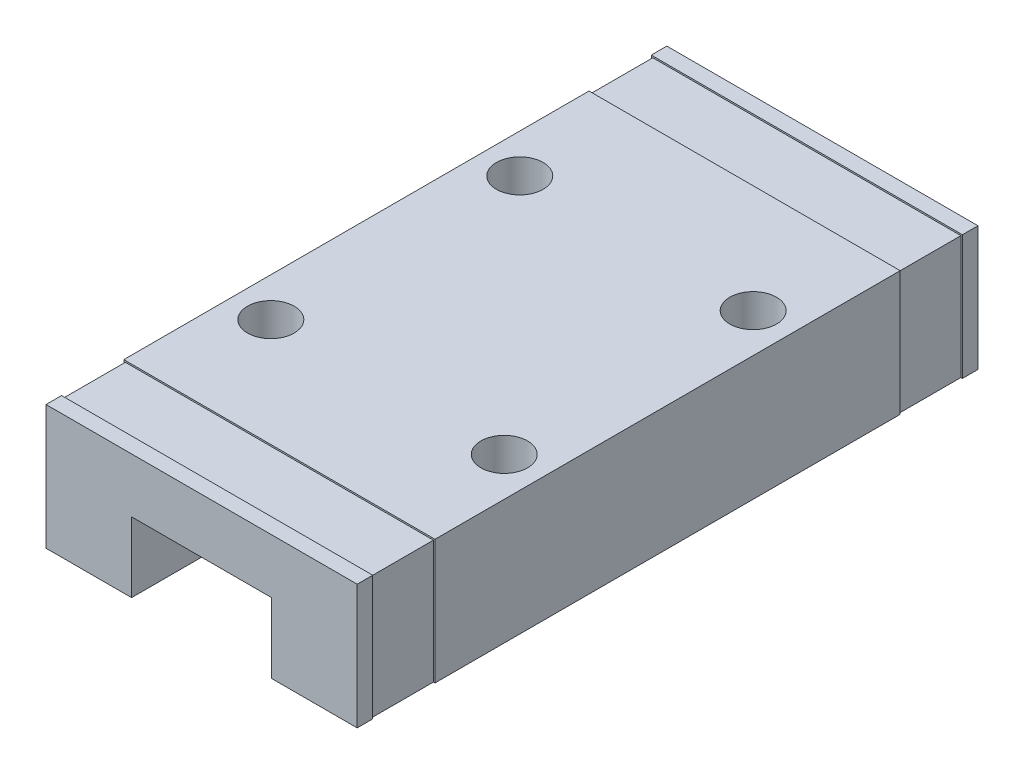
ISO-10303-21;
HEADER;
FILE_DESCRIPTION(('STEP AP214'),'2;1');
FILE_NAME('part.step','',(''),(''),'','','');
FILE_SCHEMA(('AUTOMOTIVE_DESIGN { 1 0 10303 214 1 1 1 1 }'));
ENDSEC;
DATA;
#1=APPLICATION_CONTEXT('core data for automotive mechanical design processes');
#2=APPLICATION_PROTOCOL_DEFINITION('international standard','automotive_design',2000,#1);
#3=PRODUCT_CONTEXT('',#1,'mechanical');
#4=PRODUCT('Part','Part','',(#3));
#5=PRODUCT_RELATED_PRODUCT_CATEGORY('part','',(#4));
#6=PRODUCT_DEFINITION_FORMATION('','',#4);
#7=PRODUCT_DEFINITION_CONTEXT('part definition',#1,'design');
#8=PRODUCT_DEFINITION('design','',#6,#7);
#9=PRODUCT_DEFINITION_SHAPE('','',#8);
#10=(LENGTH_UNIT() NAMED_UNIT(*) SI_UNIT(.MILLI.,.METRE.));
#11=(NAMED_UNIT(*) PLANE_ANGLE_UNIT() SI_UNIT($,.RADIAN.));
#12=(NAMED_UNIT(*) SI_UNIT($,.STERADIAN.) SOLID_ANGLE_UNIT());
#13=UNCERTAINTY_MEASURE_WITH_UNIT(LENGTH_MEASURE(1.E-05),#10,'distance_accuracy_value','');
#14=(GEOMETRIC_REPRESENTATION_CONTEXT(3) GLOBAL_UNCERTAINTY_ASSIGNED_CONTEXT((#13)) GLOBAL_UNIT_ASSIGNED_CONTEXT((#10,
#11,#12)) REPRESENTATION_CONTEXT('',''));
#15=CARTESIAN_POINT('',(0.,0.,0.));
#16=DIRECTION('',(0.,0.,1.));
#17=DIRECTION('',(1.,0.,0.));
#18=AXIS2_PLACEMENT_3D('',#15,#16,#17);
#19=CARTESIAN_POINT('',(20.,0.,39.9));
#20=DIRECTION('',(-1.,0.,0.));
#21=DIRECTION('',(0.,0.,1.));
#22=AXIS2_PLACEMENT_3D('',#19,#20,#21);
#23=PLANE('',#22);
#24=DIRECTION('',(0.,1.,0.));
#25=VECTOR('',#24,1.);
#26=CARTESIAN_POINT('',(20.,7.9,34.9));
#27=LINE('',#26,#25);
#28=CARTESIAN_POINT('',(20.,0.,34.9));
#29=VERTEX_POINT('',#28);
#30=CARTESIAN_POINT('',(20.,8.,34.9));
#31=VERTEX_POINT('',#30);
#32=EDGE_CURVE('E245',#29,#31,#27,.T.);
#33=ORIENTED_EDGE('',*,*,#32,.F.);
#34=DIRECTION('',(0.,0.,-1.));
#35=VECTOR('',#34,1.);
#36=CARTESIAN_POINT('',(20.,0.,39.9));
#37=LINE('',#36,#35);
#38=CARTESIAN_POINT('',(20.,0.,5.));
#39=VERTEX_POINT('',#38);
#40=EDGE_CURVE('E315',#29,#39,#37,.T.);
#41=ORIENTED_EDGE('',*,*,#40,.T.);
#42=DIRECTION('',(0.,1.,0.));
#43=VECTOR('',#42,1.);
#44=CARTESIAN_POINT('',(20.,7.9,5.));
#45=LINE('',#44,#43);
#46=CARTESIAN_POINT('',(20.,8.,5.));
#47=VERTEX_POINT('',#46);
#48=EDGE_CURVE('E354',#39,#47,#45,.T.);
#49=ORIENTED_EDGE('',*,*,#48,.T.);
#50=DIRECTION('',(0.,0.,-1.));
#51=VECTOR('',#50,1.);
#52=CARTESIAN_POINT('',(20.,8.,39.9));
#53=LINE('',#52,#51);
#54=EDGE_CURVE('E313',#31,#47,#53,.T.);
#55=ORIENTED_EDGE('',*,*,#54,.F.);
#56=EDGE_LOOP('',(#33,#41,#49,#55));
#57=FACE_BOUND('',#56,.T.);
#58=ADVANCED_FACE('F45',(#57),#23,.F.);
#59=CARTESIAN_POINT('',(20.,0.,39.9));
#60=VERTEX_POINT('',#59);
#61=CARTESIAN_POINT('',(20.,0.,38.9));
#62=VERTEX_POINT('',#61);
#63=EDGE_CURVE('E53',#60,#62,#37,.T.);
#64=ORIENTED_EDGE('',*,*,#63,.T.);
#65=DIRECTION('',(0.,1.,0.));
#66=VECTOR('',#65,1.);
#67=CARTESIAN_POINT('',(20.,7.9,38.9));
#68=LINE('',#67,#66);
#69=CARTESIAN_POINT('',(20.,8.,38.9));
#70=VERTEX_POINT('',#69);
#71=EDGE_CURVE('E231',#62,#70,#68,.T.);
#72=ORIENTED_EDGE('',*,*,#71,.T.);
#73=CARTESIAN_POINT('',(20.,8.,39.9));
#74=VERTEX_POINT('',#73);
#75=EDGE_CURVE('E310',#74,#70,#53,.T.);
#76=ORIENTED_EDGE('',*,*,#75,.F.);
#77=DIRECTION('',(0.,1.,0.));
#78=VECTOR('',#77,1.);
#79=CARTESIAN_POINT('',(20.,0.,39.9));
#80=LINE('',#79,#78);
#81=EDGE_CURVE('E255',#60,#74,#80,.T.);
#82=ORIENTED_EDGE('',*,*,#81,.F.);
#83=EDGE_LOOP('',(#64,#72,#76,#82));
#84=FACE_BOUND('',#83,.T.);
#85=ADVANCED_FACE('F474',(#84),#23,.F.);
#86=CARTESIAN_POINT('',(0.,7.9,0.));
#87=DIRECTION('',(0.,1.,0.));
#88=DIRECTION('',(-1.,0.,0.));
#89=AXIS2_PLACEMENT_3D('',#86,#87,#88);
#90=PLANE('',#89);
#91=DIRECTION('',(1.,0.,0.));
#92=VECTOR('',#91,1.);
#93=CARTESIAN_POINT('',(0.,7.9,5.));
#94=LINE('',#93,#92);
#95=CARTESIAN_POINT('',(0.1,7.9,5.));
#96=VERTEX_POINT('',#95);
#97=CARTESIAN_POINT('',(19.9,7.9,5.));
#98=VERTEX_POINT('',#97);
#99=EDGE_CURVE('E365',#96,#98,#94,.T.);
#100=ORIENTED_EDGE('',*,*,#99,.T.);
#101=DIRECTION('',(0.,0.,1.));
#102=VECTOR('',#101,1.);
#103=CARTESIAN_POINT('',(19.9,7.9,5.));
#104=LINE('',#103,#102);
#105=CARTESIAN_POINT('',(19.9,7.9,1.));
#106=VERTEX_POINT('',#105);
#107=EDGE_CURVE('E403',#106,#98,#104,.T.);
#108=ORIENTED_EDGE('',*,*,#107,.F.);
#109=DIRECTION('',(-1.,0.,0.));
#110=VECTOR('',#109,1.);
#111=CARTESIAN_POINT('',(0.,7.9,1.));
#112=LINE('',#111,#110);
#113=CARTESIAN_POINT('',(0.1,7.9,1.));
#114=VERTEX_POINT('',#113);
#115=EDGE_CURVE('E360',#106,#114,#112,.T.);
#116=ORIENTED_EDGE('',*,*,#115,.T.);
#117=DIRECTION('',(0.,0.,-1.));
#118=VECTOR('',#117,1.);
#119=CARTESIAN_POINT('',(0.1,7.9,5.));
#120=LINE('',#119,#118);
#121=EDGE_CURVE('E397',#96,#114,#120,.T.);
#122=ORIENTED_EDGE('',*,*,#121,.F.);
#123=EDGE_LOOP('',(#100,#108,#116,#122));
#124=FACE_BOUND('',#123,.T.);
#125=ADVANCED_FACE('F479',(#124),#90,.T.);
#126=CARTESIAN_POINT('',(0.,0.,39.9));
#127=DIRECTION('',(-1.,0.,0.));
#128=DIRECTION('',(0.,0.,1.));
#129=AXIS2_PLACEMENT_3D('',#126,#127,#128);
#130=PLANE('',#129);
#131=DIRECTION('',(0.,1.,0.));
#132=VECTOR('',#131,1.);
#133=CARTESIAN_POINT('',(0.,7.9,5.));
#134=LINE('',#133,#132);
#135=CARTESIAN_POINT('',(0.,0.,5.));
#136=VERTEX_POINT('',#135);
#137=CARTESIAN_POINT('',(0.,8.,5.));
#138=VERTEX_POINT('',#137);
#139=EDGE_CURVE('E357',#136,#138,#134,.T.);
#140=ORIENTED_EDGE('',*,*,#139,.F.);
#141=DIRECTION('',(0.,0.,-1.));
#142=VECTOR('',#141,1.);
#143=CARTESIAN_POINT('',(0.,0.,39.9));
#144=LINE('',#143,#142);
#145=CARTESIAN_POINT('',(0.,0.,34.9));
#146=VERTEX_POINT('',#145);
#147=EDGE_CURVE('E304',#146,#136,#144,.T.);
#148=ORIENTED_EDGE('',*,*,#147,.F.);
#149=DIRECTION('',(0.,1.,0.));
#150=VECTOR('',#149,1.);
#151=CARTESIAN_POINT('',(0.,7.9,34.9));
#152=LINE('',#151,#150);
#153=CARTESIAN_POINT('',(0.,8.,34.9));
#154=VERTEX_POINT('',#153);
#155=EDGE_CURVE('E241',#146,#154,#152,.T.);
#156=ORIENTED_EDGE('',*,*,#155,.T.);
#157=DIRECTION('',(0.,0.,-1.));
#158=VECTOR('',#157,1.);
#159=CARTESIAN_POINT('',(0.,8.,39.9));
#160=LINE('',#159,#158);
#161=EDGE_CURVE('E309',#154,#138,#160,.T.);
#162=ORIENTED_EDGE('',*,*,#161,.T.);
#163=EDGE_LOOP('',(#140,#148,#156,#162));
#164=FACE_BOUND('',#163,.T.);
#165=ADVANCED_FACE('F516',(#164),#130,.T.);
#166=CARTESIAN_POINT('',(0.,0.,1.));
#167=VERTEX_POINT('',#166);
#168=CARTESIAN_POINT('',(0.,0.,0.));
#169=VERTEX_POINT('',#168);
#170=EDGE_CURVE('E299',#167,#169,#144,.T.);
#171=ORIENTED_EDGE('',*,*,#170,.F.);
#172=DIRECTION('',(0.,1.,0.));
#173=VECTOR('',#172,1.);
#174=CARTESIAN_POINT('',(0.,7.9,1.));
#175=LINE('',#174,#173);
#176=CARTESIAN_POINT('',(0.,8.,1.));
#177=VERTEX_POINT('',#176);
#178=EDGE_CURVE('E274',#167,#177,#175,.T.);
#179=ORIENTED_EDGE('',*,*,#178,.T.);
#180=CARTESIAN_POINT('',(0.,8.,0.));
#181=VERTEX_POINT('',#180);
#182=EDGE_CURVE('E303',#177,#181,#160,.T.);
#183=ORIENTED_EDGE('',*,*,#182,.T.);
#184=DIRECTION('',(0.,1.,0.));
#185=VECTOR('',#184,1.);
#186=CARTESIAN_POINT('',(0.,0.,0.));
#187=LINE('',#186,#185);
#188=EDGE_CURVE('E283',#169,#181,#187,.T.);
#189=ORIENTED_EDGE('',*,*,#188,.F.);
#190=EDGE_LOOP('',(#171,#179,#183,#189));
#191=FACE_BOUND('',#190,.T.);
#192=ADVANCED_FACE('F514',(#191),#130,.T.);
#193=CARTESIAN_POINT('',(0.,7.9,0.));
#194=DIRECTION('',(0.,-1.,0.));
#195=DIRECTION('',(1.,0.,0.));
#196=AXIS2_PLACEMENT_3D('',#193,#194,#195);
#197=PLANE('',#196);
#198=DIRECTION('',(1.,0.,0.));
#199=VECTOR('',#198,1.);
#200=CARTESIAN_POINT('',(0.,7.9,38.9));
#201=LINE('',#200,#199);
#202=CARTESIAN_POINT('',(0.1,7.9,38.9));
#203=VERTEX_POINT('',#202);
#204=CARTESIAN_POINT('',(19.9,7.9,38.9));
#205=VERTEX_POINT('',#204);
#206=EDGE_CURVE('E222',#203,#205,#201,.T.);
#207=ORIENTED_EDGE('',*,*,#206,.T.);
#208=DIRECTION('',(0.,0.,1.));
#209=VECTOR('',#208,1.);
#210=CARTESIAN_POINT('',(19.9,7.9,34.9));
#211=LINE('',#210,#209);
#212=CARTESIAN_POINT('',(19.9,7.9,34.9));
#213=VERTEX_POINT('',#212);
#214=EDGE_CURVE('E60',#213,#205,#211,.T.);
#215=ORIENTED_EDGE('',*,*,#214,.F.);
#216=DIRECTION('',(-1.,0.,0.));
#217=VECTOR('',#216,1.);
#218=CARTESIAN_POINT('',(0.,7.9,34.9));
#219=LINE('',#218,#217);
#220=CARTESIAN_POINT('',(0.1,7.9,34.9));
#221=VERTEX_POINT('',#220);
#222=EDGE_CURVE('E219',#213,#221,#219,.T.);
#223=ORIENTED_EDGE('',*,*,#222,.T.);
#224=DIRECTION('',(0.,0.,-1.));
#225=VECTOR('',#224,1.);
#226=CARTESIAN_POINT('',(0.1,7.9,34.9));
#227=LINE('',#226,#225);
#228=EDGE_CURVE('E374',#203,#221,#227,.T.);
#229=ORIENTED_EDGE('',*,*,#228,.F.);
#230=EDGE_LOOP('',(#207,#215,#223,#229));
#231=FACE_BOUND('',#230,.T.);
#232=ADVANCED_FACE('F217',(#231),#197,.F.);
#233=CARTESIAN_POINT('',(0.,8.,39.9));
#234=DIRECTION('',(0.,1.,0.));
#235=DIRECTION('',(-1.,0.,0.));
#236=AXIS2_PLACEMENT_3D('',#233,#234,#235);
#237=PLANE('',#236);
#238=DIRECTION('',(-1.,0.,0.));
#239=VECTOR('',#238,1.);
#240=CARTESIAN_POINT('',(0.,8.,1.));
#241=LINE('',#240,#239);
#242=CARTESIAN_POINT('',(20.,8.,1.));
#243=VERTEX_POINT('',#242);
#244=EDGE_CURVE('E343',#243,#177,#241,.T.);
#245=ORIENTED_EDGE('',*,*,#244,.F.);
#246=CARTESIAN_POINT('',(20.,8.,0.));
#247=VERTEX_POINT('',#246);
#248=EDGE_CURVE('E308',#243,#247,#53,.T.);
#249=ORIENTED_EDGE('',*,*,#248,.T.);
#250=DIRECTION('',(1.,0.,0.));
#251=VECTOR('',#250,1.);
#252=CARTESIAN_POINT('',(0.,8.,0.));
#253=LINE('',#252,#251);
#254=EDGE_CURVE('E280',#181,#247,#253,.T.);
#255=ORIENTED_EDGE('',*,*,#254,.F.);
#256=ORIENTED_EDGE('',*,*,#182,.F.);
#257=EDGE_LOOP('',(#245,#249,#255,#256));
#258=FACE_BOUND('',#257,.T.);
#259=ADVANCED_FACE('F342',(#258),#237,.T.);
#260=CARTESIAN_POINT('',(17.5,8.,11.95));
#261=DIRECTION('',(0.,1.,0.));
#262=DIRECTION('',(-1.,0.,0.));
#263=AXIS2_PLACEMENT_3D('',#260,#261,#262);
#264=CIRCLE('',#263,1.5);
#265=CARTESIAN_POINT('',(16.,8.,11.95));
#266=VERTEX_POINT('',#265);
#267=EDGE_CURVE('E432',#266,#266,#264,.T.);
#268=ORIENTED_EDGE('',*,*,#267,.F.);
#269=EDGE_LOOP('',(#268));
#270=FACE_BOUND('',#269,.T.);
#271=CARTESIAN_POINT('',(2.5,8.,27.95));
#272=DIRECTION('',(0.,1.,0.));
#273=DIRECTION('',(-1.,0.,0.));
#274=AXIS2_PLACEMENT_3D('',#271,#272,#273);
#275=CIRCLE('',#274,1.5);
#276=CARTESIAN_POINT('',(1.,8.,27.95));
#277=VERTEX_POINT('',#276);
#278=EDGE_CURVE('E425',#277,#277,#275,.T.);
#279=ORIENTED_EDGE('',*,*,#278,.F.);
#280=EDGE_LOOP('',(#279));
#281=FACE_BOUND('',#280,.T.);
#282=CARTESIAN_POINT('',(17.5,8.,27.95));
#283=DIRECTION('',(0.,1.,0.));
#284=DIRECTION('',(-1.,0.,0.));
#285=AXIS2_PLACEMENT_3D('',#282,#283,#284);
#286=CIRCLE('',#285,1.5);
#287=CARTESIAN_POINT('',(16.,8.,27.95));
#288=VERTEX_POINT('',#287);
#289=EDGE_CURVE('E437',#288,#288,#286,.T.);
#290=ORIENTED_EDGE('',*,*,#289,.F.);
#291=EDGE_LOOP('',(#290));
#292=FACE_BOUND('',#291,.T.);
#293=CARTESIAN_POINT('',(2.5,8.,11.95));
#294=DIRECTION('',(0.,1.,0.));
#295=DIRECTION('',(-1.,0.,0.));
#296=AXIS2_PLACEMENT_3D('',#293,#294,#295);
#297=CIRCLE('',#296,1.5);
#298=CARTESIAN_POINT('',(1.,8.,11.95));
#299=VERTEX_POINT('',#298);
#300=EDGE_CURVE('E419',#299,#299,#297,.T.);
#301=ORIENTED_EDGE('',*,*,#300,.F.);
#302=EDGE_LOOP('',(#301));
#303=FACE_BOUND('',#302,.T.);
#304=DIRECTION('',(1.,0.,0.));
#305=VECTOR('',#304,1.);
#306=CARTESIAN_POINT('',(0.,8.,5.));
#307=LINE('',#306,#305);
#308=EDGE_CURVE('E244',#138,#47,#307,.T.);
#309=ORIENTED_EDGE('',*,*,#308,.F.);
#310=ORIENTED_EDGE('',*,*,#161,.F.);
#311=DIRECTION('',(-1.,0.,0.));
#312=VECTOR('',#311,1.);
#313=CARTESIAN_POINT('',(0.,8.,34.9));
#314=LINE('',#313,#312);
#315=EDGE_CURVE('E233',#31,#154,#314,.T.);
#316=ORIENTED_EDGE('',*,*,#315,.F.);
#317=ORIENTED_EDGE('',*,*,#54,.T.);
#318=EDGE_LOOP('',(#309,#310,#316,#317));
#319=FACE_BOUND('',#318,.T.);
#320=ADVANCED_FACE('F349',(#270,#281,#292,#303,#319),#237,.T.);
#321=CARTESIAN_POINT('',(14.5,0.,39.9));
#322=DIRECTION('',(-1.,0.,0.));
#323=DIRECTION('',(0.,0.,1.));
#324=AXIS2_PLACEMENT_3D('',#321,#322,#323);
#325=PLANE('',#324);
#326=DIRECTION('',(0.,1.,0.));
#327=VECTOR('',#326,1.);
#328=CARTESIAN_POINT('',(14.5,0.,0.));
#329=LINE('',#328,#327);
#330=CARTESIAN_POINT('',(14.5,0.,0.));
#331=VERTEX_POINT('',#330);
#332=CARTESIAN_POINT('',(14.5,4.5,0.));
#333=VERTEX_POINT('',#332);
#334=EDGE_CURVE('E270',#331,#333,#329,.T.);
#335=ORIENTED_EDGE('',*,*,#334,.F.);
#336=DIRECTION('',(0.,0.,-1.));
#337=VECTOR('',#336,1.);
#338=CARTESIAN_POINT('',(14.5,0.,39.9));
#339=LINE('',#338,#337);
#340=CARTESIAN_POINT('',(14.5,0.,39.9));
#341=VERTEX_POINT('',#340);
#342=EDGE_CURVE('E11',#341,#331,#339,.T.);
#343=ORIENTED_EDGE('',*,*,#342,.F.);
#344=DIRECTION('',(0.,1.,0.));
#345=VECTOR('',#344,1.);
#346=CARTESIAN_POINT('',(14.5,0.,39.9));
#347=LINE('',#346,#345);
#348=CARTESIAN_POINT('',(14.5,4.5,39.9));
#349=VERTEX_POINT('',#348);
#350=EDGE_CURVE('E249',#341,#349,#347,.T.);
#351=ORIENTED_EDGE('',*,*,#350,.T.);
#352=DIRECTION('',(0.,0.,-1.));
#353=VECTOR('',#352,1.);
#354=CARTESIAN_POINT('',(14.5,4.5,39.9));
#355=LINE('',#354,#353);
#356=EDGE_CURVE('E269',#349,#333,#355,.T.);
#357=ORIENTED_EDGE('',*,*,#356,.T.);
#358=EDGE_LOOP('',(#335,#343,#351,#357));
#359=FACE_BOUND('',#358,.T.);
#360=ADVANCED_FACE('F47',(#359),#325,.T.);
#361=CARTESIAN_POINT('',(0.,0.,39.9));
#362=DIRECTION('',(0.,1.,0.));
#363=DIRECTION('',(0.,0.,1.));
#364=AXIS2_PLACEMENT_3D('',#361,#362,#363);
#365=PLANE('',#364);
#366=ORIENTED_EDGE('',*,*,#40,.F.);
#367=DIRECTION('',(1.,0.,0.));
#368=VECTOR('',#367,1.);
#369=CARTESIAN_POINT('',(19.9,0.,34.9));
#370=LINE('',#369,#368);
#371=CARTESIAN_POINT('',(19.9,0.,34.9));
#372=VERTEX_POINT('',#371);
#373=EDGE_CURVE('E385',#372,#29,#370,.T.);
#374=ORIENTED_EDGE('',*,*,#373,.F.);
#375=DIRECTION('',(0.,0.,-1.));
#376=VECTOR('',#375,1.);
#377=CARTESIAN_POINT('',(19.9,0.,34.9));
#378=LINE('',#377,#376);
#379=CARTESIAN_POINT('',(19.9,0.,38.9));
#380=VERTEX_POINT('',#379);
#381=EDGE_CURVE('E208',#380,#372,#378,.T.);
#382=ORIENTED_EDGE('',*,*,#381,.F.);
#383=DIRECTION('',(1.,0.,0.));
#384=VECTOR('',#383,1.);
#385=CARTESIAN_POINT('',(19.9,0.,38.9));
#386=LINE('',#385,#384);
#387=EDGE_CURVE('E413',#380,#62,#386,.T.);
#388=ORIENTED_EDGE('',*,*,#387,.T.);
#389=ORIENTED_EDGE('',*,*,#63,.F.);
#390=DIRECTION('',(1.,0.,0.));
#391=VECTOR('',#390,1.);
#392=CARTESIAN_POINT('',(0.,0.,39.9));
#393=LINE('',#392,#391);
#394=EDGE_CURVE('E252',#341,#60,#393,.T.);
#395=ORIENTED_EDGE('',*,*,#394,.F.);
#396=ORIENTED_EDGE('',*,*,#342,.T.);
#397=DIRECTION('',(1.,0.,0.));
#398=VECTOR('',#397,1.);
#399=CARTESIAN_POINT('',(0.,0.,0.));
#400=LINE('',#399,#398);
#401=CARTESIAN_POINT('',(20.,0.,0.));
#402=VERTEX_POINT('',#401);
#403=EDGE_CURVE('E273',#331,#402,#400,.T.);
#404=ORIENTED_EDGE('',*,*,#403,.T.);
#405=CARTESIAN_POINT('',(20.,0.,1.));
#406=VERTEX_POINT('',#405);
#407=EDGE_CURVE('E312',#406,#402,#37,.T.);
#408=ORIENTED_EDGE('',*,*,#407,.F.);
#409=DIRECTION('',(1.,0.,0.));
#410=VECTOR('',#409,1.);
#411=CARTESIAN_POINT('',(19.9,0.,1.));
#412=LINE('',#411,#410);
#413=CARTESIAN_POINT('',(19.9,0.,1.));
#414=VERTEX_POINT('',#413);
#415=EDGE_CURVE('E213',#414,#406,#412,.T.);
#416=ORIENTED_EDGE('',*,*,#415,.F.);
#417=DIRECTION('',(0.,0.,-1.));
#418=VECTOR('',#417,1.);
#419=CARTESIAN_POINT('',(19.9,0.,5.));
#420=LINE('',#419,#418);
#421=CARTESIAN_POINT('',(19.9,0.,5.));
#422=VERTEX_POINT('',#421);
#423=EDGE_CURVE('E407',#422,#414,#420,.T.);
#424=ORIENTED_EDGE('',*,*,#423,.F.);
#425=DIRECTION('',(1.,0.,0.));
#426=VECTOR('',#425,1.);
#427=CARTESIAN_POINT('',(19.9,0.,5.));
#428=LINE('',#427,#426);
#429=EDGE_CURVE('E401',#422,#39,#428,.T.);
#430=ORIENTED_EDGE('',*,*,#429,.T.);
#431=EDGE_LOOP('',(#366,#374,#382,#388,#389,#395,#396,#404,#408,#416,#424,#430));
#432=FACE_BOUND('',#431,.T.);
#433=ADVANCED_FACE('F331',(#432),#365,.F.);
#434=DIRECTION('',(0.,1.,0.));
#435=VECTOR('',#434,1.);
#436=CARTESIAN_POINT('',(20.,7.9,1.));
#437=LINE('',#436,#435);
#438=EDGE_CURVE('E325',#406,#243,#437,.T.);
#439=ORIENTED_EDGE('',*,*,#438,.F.);
#440=ORIENTED_EDGE('',*,*,#407,.T.);
#441=DIRECTION('',(0.,1.,0.));
#442=VECTOR('',#441,1.);
#443=CARTESIAN_POINT('',(20.,0.,0.));
#444=LINE('',#443,#442);
#445=EDGE_CURVE('E277',#402,#247,#444,.T.);
#446=ORIENTED_EDGE('',*,*,#445,.T.);
#447=ORIENTED_EDGE('',*,*,#248,.F.);
#448=EDGE_LOOP('',(#439,#440,#446,#447));
#449=FACE_BOUND('',#448,.T.);
#450=ADVANCED_FACE('F322',(#449),#23,.F.);
#451=DIRECTION('',(1.,0.,0.));
#452=VECTOR('',#451,1.);
#453=CARTESIAN_POINT('',(0.,8.,38.9));
#454=LINE('',#453,#452);
#455=CARTESIAN_POINT('',(0.,8.,38.9));
#456=VERTEX_POINT('',#455);
#457=EDGE_CURVE('E237',#456,#70,#454,.T.);
#458=ORIENTED_EDGE('',*,*,#457,.F.);
#459=CARTESIAN_POINT('',(0.,8.,39.9));
#460=VERTEX_POINT('',#459);
#461=EDGE_CURVE('E305',#460,#456,#160,.T.);
#462=ORIENTED_EDGE('',*,*,#461,.F.);
#463=DIRECTION('',(1.,0.,0.));
#464=VECTOR('',#463,1.);
#465=CARTESIAN_POINT('',(0.,8.,39.9));
#466=LINE('',#465,#464);
#467=EDGE_CURVE('E257',#460,#74,#466,.T.);
#468=ORIENTED_EDGE('',*,*,#467,.T.);
#469=ORIENTED_EDGE('',*,*,#75,.T.);
#470=EDGE_LOOP('',(#458,#462,#468,#469));
#471=FACE_BOUND('',#470,.T.);
#472=ADVANCED_FACE('F456',(#471),#237,.T.);
#473=DIRECTION('',(0.,1.,0.));
#474=VECTOR('',#473,1.);
#475=CARTESIAN_POINT('',(0.,7.9,38.9));
#476=LINE('',#475,#474);
#477=CARTESIAN_POINT('',(0.,0.,38.9));
#478=VERTEX_POINT('',#477);
#479=EDGE_CURVE('E229',#478,#456,#476,.T.);
#480=ORIENTED_EDGE('',*,*,#479,.F.);
#481=CARTESIAN_POINT('',(0.,0.,39.9));
#482=VERTEX_POINT('',#481);
#483=EDGE_CURVE('E300',#482,#478,#144,.T.);
#484=ORIENTED_EDGE('',*,*,#483,.F.);
#485=DIRECTION('',(0.,1.,0.));
#486=VECTOR('',#485,1.);
#487=CARTESIAN_POINT('',(0.,0.,39.9));
#488=LINE('',#487,#486);
#489=EDGE_CURVE('E260',#482,#460,#488,.T.);
#490=ORIENTED_EDGE('',*,*,#489,.T.);
#491=ORIENTED_EDGE('',*,*,#461,.T.);
#492=EDGE_LOOP('',(#480,#484,#490,#491));
#493=FACE_BOUND('',#492,.T.);
#494=ADVANCED_FACE('F484',(#493),#130,.T.);
#495=CARTESIAN_POINT('',(0.,0.,39.9));
#496=DIRECTION('',(0.,1.,0.));
#497=DIRECTION('',(0.,0.,1.));
#498=AXIS2_PLACEMENT_3D('',#495,#496,#497);
#499=PLANE('',#498);
#500=ORIENTED_EDGE('',*,*,#147,.T.);
#501=DIRECTION('',(-1.,0.,0.));
#502=VECTOR('',#501,1.);
#503=CARTESIAN_POINT('',(0.1,0.,5.));
#504=LINE('',#503,#502);
#505=CARTESIAN_POINT('',(0.1,0.,5.));
#506=VERTEX_POINT('',#505);
#507=EDGE_CURVE('E239',#506,#136,#504,.T.);
#508=ORIENTED_EDGE('',*,*,#507,.F.);
#509=DIRECTION('',(0.,0.,1.));
#510=VECTOR('',#509,1.);
#511=CARTESIAN_POINT('',(0.1,0.,5.));
#512=LINE('',#511,#510);
#513=CARTESIAN_POINT('',(0.1,0.,1.));
#514=VERTEX_POINT('',#513);
#515=EDGE_CURVE('E389',#514,#506,#512,.T.);
#516=ORIENTED_EDGE('',*,*,#515,.F.);
#517=DIRECTION('',(-1.,0.,0.));
#518=VECTOR('',#517,1.);
#519=CARTESIAN_POINT('',(0.1,0.,1.));
#520=LINE('',#519,#518);
#521=EDGE_CURVE('E386',#514,#167,#520,.T.);
#522=ORIENTED_EDGE('',*,*,#521,.T.);
#523=ORIENTED_EDGE('',*,*,#170,.T.);
#524=DIRECTION('',(1.,0.,0.));
#525=VECTOR('',#524,1.);
#526=CARTESIAN_POINT('',(0.,0.,0.));
#527=LINE('',#526,#525);
#528=CARTESIAN_POINT('',(5.5,0.,0.));
#529=VERTEX_POINT('',#528);
#530=EDGE_CURVE('E286',#169,#529,#527,.T.);
#531=ORIENTED_EDGE('',*,*,#530,.T.);
#532=DIRECTION('',(0.,0.,-1.));
#533=VECTOR('',#532,1.);
#534=CARTESIAN_POINT('',(5.5,0.,39.9));
#535=LINE('',#534,#533);
#536=CARTESIAN_POINT('',(5.5,0.,39.9));
#537=VERTEX_POINT('',#536);
#538=EDGE_CURVE('E296',#537,#529,#535,.T.);
#539=ORIENTED_EDGE('',*,*,#538,.F.);
#540=DIRECTION('',(1.,0.,0.));
#541=VECTOR('',#540,1.);
#542=CARTESIAN_POINT('',(0.,0.,39.9));
#543=LINE('',#542,#541);
#544=EDGE_CURVE('E263',#482,#537,#543,.T.);
#545=ORIENTED_EDGE('',*,*,#544,.F.);
#546=ORIENTED_EDGE('',*,*,#483,.T.);
#547=DIRECTION('',(-1.,0.,0.));
#548=VECTOR('',#547,1.);
#549=CARTESIAN_POINT('',(0.1,0.,38.9));
#550=LINE('',#549,#548);
#551=CARTESIAN_POINT('',(0.1,0.,38.9));
#552=VERTEX_POINT('',#551);
#553=EDGE_CURVE('E373',#552,#478,#550,.T.);
#554=ORIENTED_EDGE('',*,*,#553,.F.);
#555=DIRECTION('',(0.,0.,1.));
#556=VECTOR('',#555,1.);
#557=CARTESIAN_POINT('',(0.1,0.,34.9));
#558=LINE('',#557,#556);
#559=CARTESIAN_POINT('',(0.1,0.,34.9));
#560=VERTEX_POINT('',#559);
#561=EDGE_CURVE('E381',#560,#552,#558,.T.);
#562=ORIENTED_EDGE('',*,*,#561,.F.);
#563=DIRECTION('',(-1.,0.,0.));
#564=VECTOR('',#563,1.);
#565=CARTESIAN_POINT('',(0.1,0.,34.9));
#566=LINE('',#565,#564);
#567=EDGE_CURVE('E370',#560,#146,#566,.T.);
#568=ORIENTED_EDGE('',*,*,#567,.T.);
#569=EDGE_LOOP('',(#500,#508,#516,#522,#523,#531,#539,#545,#546,#554,#562,#568));
#570=FACE_BOUND('',#569,.T.);
#571=ADVANCED_FACE('F510',(#570),#499,.F.);
#572=CARTESIAN_POINT('',(5.5,0.,39.9));
#573=DIRECTION('',(-1.,0.,0.));
#574=DIRECTION('',(0.,0.,1.));
#575=AXIS2_PLACEMENT_3D('',#572,#573,#574);
#576=PLANE('',#575);
#577=DIRECTION('',(0.,1.,0.));
#578=VECTOR('',#577,1.);
#579=CARTESIAN_POINT('',(5.5,0.,0.));
#580=LINE('',#579,#578);
#581=CARTESIAN_POINT('',(5.5,4.5,0.));
#582=VERTEX_POINT('',#581);
#583=EDGE_CURVE('E288',#529,#582,#580,.T.);
#584=ORIENTED_EDGE('',*,*,#583,.T.);
#585=DIRECTION('',(0.,0.,-1.));
#586=VECTOR('',#585,1.);
#587=CARTESIAN_POINT('',(5.5,4.5,39.9));
#588=LINE('',#587,#586);
#589=CARTESIAN_POINT('',(5.5,4.5,39.9));
#590=VERTEX_POINT('',#589);
#591=EDGE_CURVE('E293',#590,#582,#588,.T.);
#592=ORIENTED_EDGE('',*,*,#591,.F.);
#593=DIRECTION('',(0.,1.,0.));
#594=VECTOR('',#593,1.);
#595=CARTESIAN_POINT('',(5.5,0.,39.9));
#596=LINE('',#595,#594);
#597=EDGE_CURVE('E265',#537,#590,#596,.T.);
#598=ORIENTED_EDGE('',*,*,#597,.F.);
#599=ORIENTED_EDGE('',*,*,#538,.T.);
#600=EDGE_LOOP('',(#584,#592,#598,#599));
#601=FACE_BOUND('',#600,.T.);
#602=ADVANCED_FACE('F505',(#601),#576,.F.);
#603=CARTESIAN_POINT('',(0.,4.5,39.9));
#604=DIRECTION('',(0.,1.,0.));
#605=DIRECTION('',(-1.,0.,0.));
#606=AXIS2_PLACEMENT_3D('',#603,#604,#605);
#607=PLANE('',#606);
#608=DIRECTION('',(1.,0.,0.));
#609=VECTOR('',#608,1.);
#610=CARTESIAN_POINT('',(0.,4.5,0.));
#611=LINE('',#610,#609);
#612=EDGE_CURVE('E253',#582,#333,#611,.T.);
#613=ORIENTED_EDGE('',*,*,#612,.T.);
#614=ORIENTED_EDGE('',*,*,#356,.F.);
#615=DIRECTION('',(1.,0.,0.));
#616=VECTOR('',#615,1.);
#617=CARTESIAN_POINT('',(0.,4.5,39.9));
#618=LINE('',#617,#616);
#619=EDGE_CURVE('E267',#590,#349,#618,.T.);
#620=ORIENTED_EDGE('',*,*,#619,.F.);
#621=ORIENTED_EDGE('',*,*,#591,.T.);
#622=EDGE_LOOP('',(#613,#614,#620,#621));
#623=FACE_BOUND('',#622,.T.);
#624=ADVANCED_FACE('F500',(#623),#607,.F.);
#625=CARTESIAN_POINT('',(0.,0.,39.9));
#626=DIRECTION('',(0.,0.,1.));
#627=DIRECTION('',(1.,0.,0.));
#628=AXIS2_PLACEMENT_3D('',#625,#626,#627);
#629=PLANE('',#628);
#630=ORIENTED_EDGE('',*,*,#350,.F.);
#631=ORIENTED_EDGE('',*,*,#394,.T.);
#632=ORIENTED_EDGE('',*,*,#81,.T.);
#633=ORIENTED_EDGE('',*,*,#467,.F.);
#634=ORIENTED_EDGE('',*,*,#489,.F.);
#635=ORIENTED_EDGE('',*,*,#544,.T.);
#636=ORIENTED_EDGE('',*,*,#597,.T.);
#637=ORIENTED_EDGE('',*,*,#619,.T.);
#638=EDGE_LOOP('',(#630,#631,#632,#633,#634,#635,#636,#637));
#639=FACE_BOUND('',#638,.T.);
#640=ADVANCED_FACE('F552',(#639),#629,.T.);
#641=CARTESIAN_POINT('',(0.,0.,0.));
#642=DIRECTION('',(0.,0.,1.));
#643=DIRECTION('',(1.,0.,0.));
#644=AXIS2_PLACEMENT_3D('',#641,#642,#643);
#645=PLANE('',#644);
#646=ORIENTED_EDGE('',*,*,#334,.T.);
#647=ORIENTED_EDGE('',*,*,#612,.F.);
#648=ORIENTED_EDGE('',*,*,#583,.F.);
#649=ORIENTED_EDGE('',*,*,#530,.F.);
#650=ORIENTED_EDGE('',*,*,#188,.T.);
#651=ORIENTED_EDGE('',*,*,#254,.T.);
#652=ORIENTED_EDGE('',*,*,#445,.F.);
#653=ORIENTED_EDGE('',*,*,#403,.F.);
#654=EDGE_LOOP('',(#646,#647,#648,#649,#650,#651,#652,#653));
#655=FACE_BOUND('',#654,.T.);
#656=ADVANCED_FACE('F335',(#655),#645,.F.);
#657=CARTESIAN_POINT('',(0.,7.9,34.9));
#658=DIRECTION('',(0.,0.,-1.));
#659=DIRECTION('',(-1.,0.,0.));
#660=AXIS2_PLACEMENT_3D('',#657,#658,#659);
#661=PLANE('',#660);
#662=ORIENTED_EDGE('',*,*,#315,.T.);
#663=ORIENTED_EDGE('',*,*,#155,.F.);
#664=ORIENTED_EDGE('',*,*,#567,.F.);
#665=DIRECTION('',(0.,-1.,0.));
#666=VECTOR('',#665,1.);
#667=CARTESIAN_POINT('',(0.1,7.9,34.9));
#668=LINE('',#667,#666);
#669=EDGE_CURVE('E227',#221,#560,#668,.T.);
#670=ORIENTED_EDGE('',*,*,#669,.F.);
#671=ORIENTED_EDGE('',*,*,#222,.F.);
#672=DIRECTION('',(0.,1.,0.));
#673=VECTOR('',#672,1.);
#674=CARTESIAN_POINT('',(19.9,7.9,34.9));
#675=LINE('',#674,#673);
#676=EDGE_CURVE('E205',#372,#213,#675,.T.);
#677=ORIENTED_EDGE('',*,*,#676,.F.);
#678=ORIENTED_EDGE('',*,*,#373,.T.);
#679=ORIENTED_EDGE('',*,*,#32,.T.);
#680=EDGE_LOOP('',(#662,#663,#664,#670,#671,#677,#678,#679));
#681=FACE_BOUND('',#680,.T.);
#682=ADVANCED_FACE('F225',(#681),#661,.F.);
#683=CARTESIAN_POINT('',(0.,7.9,38.9));
#684=DIRECTION('',(0.,0.,1.));
#685=DIRECTION('',(1.,0.,0.));
#686=AXIS2_PLACEMENT_3D('',#683,#684,#685);
#687=PLANE('',#686);
#688=ORIENTED_EDGE('',*,*,#457,.T.);
#689=ORIENTED_EDGE('',*,*,#71,.F.);
#690=ORIENTED_EDGE('',*,*,#387,.F.);
#691=DIRECTION('',(0.,-1.,0.));
#692=VECTOR('',#691,1.);
#693=CARTESIAN_POINT('',(19.9,7.9,38.9));
#694=LINE('',#693,#692);
#695=EDGE_CURVE('E223',#205,#380,#694,.T.);
#696=ORIENTED_EDGE('',*,*,#695,.F.);
#697=ORIENTED_EDGE('',*,*,#206,.F.);
#698=DIRECTION('',(0.,1.,0.));
#699=VECTOR('',#698,1.);
#700=CARTESIAN_POINT('',(0.1,7.9,38.9));
#701=LINE('',#700,#699);
#702=EDGE_CURVE('E379',#552,#203,#701,.T.);
#703=ORIENTED_EDGE('',*,*,#702,.F.);
#704=ORIENTED_EDGE('',*,*,#553,.T.);
#705=ORIENTED_EDGE('',*,*,#479,.T.);
#706=EDGE_LOOP('',(#688,#689,#690,#696,#697,#703,#704,#705));
#707=FACE_BOUND('',#706,.T.);
#708=ADVANCED_FACE('F524',(#707),#687,.F.);
#709=CARTESIAN_POINT('',(0.,7.9,1.));
#710=DIRECTION('',(0.,0.,-1.));
#711=DIRECTION('',(-1.,0.,0.));
#712=AXIS2_PLACEMENT_3D('',#709,#710,#711);
#713=PLANE('',#712);
#714=ORIENTED_EDGE('',*,*,#244,.T.);
#715=ORIENTED_EDGE('',*,*,#178,.F.);
#716=ORIENTED_EDGE('',*,*,#521,.F.);
#717=DIRECTION('',(0.,-1.,0.));
#718=VECTOR('',#717,1.);
#719=CARTESIAN_POINT('',(0.1,7.9,1.));
#720=LINE('',#719,#718);
#721=EDGE_CURVE('E394',#114,#514,#720,.T.);
#722=ORIENTED_EDGE('',*,*,#721,.F.);
#723=ORIENTED_EDGE('',*,*,#115,.F.);
#724=DIRECTION('',(0.,1.,0.));
#725=VECTOR('',#724,1.);
#726=CARTESIAN_POINT('',(19.9,7.9,1.));
#727=LINE('',#726,#725);
#728=EDGE_CURVE('E68',#414,#106,#727,.T.);
#729=ORIENTED_EDGE('',*,*,#728,.F.);
#730=ORIENTED_EDGE('',*,*,#415,.T.);
#731=ORIENTED_EDGE('',*,*,#438,.T.);
#732=EDGE_LOOP('',(#714,#715,#716,#722,#723,#729,#730,#731));
#733=FACE_BOUND('',#732,.T.);
#734=ADVANCED_FACE('F536',(#733),#713,.F.);
#735=CARTESIAN_POINT('',(0.,7.9,5.));
#736=DIRECTION('',(0.,0.,1.));
#737=DIRECTION('',(1.,0.,0.));
#738=AXIS2_PLACEMENT_3D('',#735,#736,#737);
#739=PLANE('',#738);
#740=ORIENTED_EDGE('',*,*,#308,.T.);
#741=ORIENTED_EDGE('',*,*,#48,.F.);
#742=ORIENTED_EDGE('',*,*,#429,.F.);
#743=DIRECTION('',(0.,-1.,0.));
#744=VECTOR('',#743,1.);
#745=CARTESIAN_POINT('',(19.9,7.9,5.));
#746=LINE('',#745,#744);
#747=EDGE_CURVE('E409',#98,#422,#746,.T.);
#748=ORIENTED_EDGE('',*,*,#747,.F.);
#749=ORIENTED_EDGE('',*,*,#99,.F.);
#750=DIRECTION('',(0.,1.,0.));
#751=VECTOR('',#750,1.);
#752=CARTESIAN_POINT('',(0.1,7.9,5.));
#753=LINE('',#752,#751);
#754=EDGE_CURVE('E377',#506,#96,#753,.T.);
#755=ORIENTED_EDGE('',*,*,#754,.F.);
#756=ORIENTED_EDGE('',*,*,#507,.T.);
#757=ORIENTED_EDGE('',*,*,#139,.T.);
#758=EDGE_LOOP('',(#740,#741,#742,#748,#749,#755,#756,#757));
#759=FACE_BOUND('',#758,.T.);
#760=ADVANCED_FACE('F526',(#759),#739,.F.);
#761=CARTESIAN_POINT('',(0.1,0.,0.));
#762=DIRECTION('',(1.,0.,0.));
#763=DIRECTION('',(0.,0.,-1.));
#764=AXIS2_PLACEMENT_3D('',#761,#762,#763);
#765=PLANE('',#764);
#766=ORIENTED_EDGE('',*,*,#754,.T.);
#767=ORIENTED_EDGE('',*,*,#121,.T.);
#768=ORIENTED_EDGE('',*,*,#721,.T.);
#769=ORIENTED_EDGE('',*,*,#515,.T.);
#770=EDGE_LOOP('',(#766,#767,#768,#769));
#771=FACE_BOUND('',#770,.T.);
#772=ADVANCED_FACE('F533',(#771),#765,.F.);
#773=CARTESIAN_POINT('',(0.1,0.,0.));
#774=DIRECTION('',(-1.,0.,0.));
#775=DIRECTION('',(0.,0.,1.));
#776=AXIS2_PLACEMENT_3D('',#773,#774,#775);
#777=PLANE('',#776);
#778=ORIENTED_EDGE('',*,*,#669,.T.);
#779=ORIENTED_EDGE('',*,*,#561,.T.);
#780=ORIENTED_EDGE('',*,*,#702,.T.);
#781=ORIENTED_EDGE('',*,*,#228,.T.);
#782=EDGE_LOOP('',(#778,#779,#780,#781));
#783=FACE_BOUND('',#782,.T.);
#784=ADVANCED_FACE('F522',(#783),#777,.T.);
#785=CARTESIAN_POINT('',(19.9,0.,0.));
#786=DIRECTION('',(1.,0.,0.));
#787=DIRECTION('',(0.,0.,-1.));
#788=AXIS2_PLACEMENT_3D('',#785,#786,#787);
#789=PLANE('',#788);
#790=ORIENTED_EDGE('',*,*,#747,.T.);
#791=ORIENTED_EDGE('',*,*,#423,.T.);
#792=ORIENTED_EDGE('',*,*,#728,.T.);
#793=ORIENTED_EDGE('',*,*,#107,.T.);
#794=EDGE_LOOP('',(#790,#791,#792,#793));
#795=FACE_BOUND('',#794,.T.);
#796=ADVANCED_FACE('F470',(#795),#789,.T.);
#797=CARTESIAN_POINT('',(19.9,0.,0.));
#798=DIRECTION('',(-1.,0.,0.));
#799=DIRECTION('',(0.,0.,1.));
#800=AXIS2_PLACEMENT_3D('',#797,#798,#799);
#801=PLANE('',#800);
#802=ORIENTED_EDGE('',*,*,#676,.T.);
#803=ORIENTED_EDGE('',*,*,#214,.T.);
#804=ORIENTED_EDGE('',*,*,#695,.T.);
#805=ORIENTED_EDGE('',*,*,#381,.T.);
#806=EDGE_LOOP('',(#802,#803,#804,#805));
#807=FACE_BOUND('',#806,.T.);
#808=ADVANCED_FACE('F206',(#807),#801,.F.);
#809=CARTESIAN_POINT('',(2.5,5.,11.95));
#810=DIRECTION('',(0.,1.,0.));
#811=DIRECTION('',(-1.,0.,0.));
#812=AXIS2_PLACEMENT_3D('',#809,#810,#811);
#813=CYLINDRICAL_SURFACE('',#812,1.5);
#814=CARTESIAN_POINT('',(2.5,5.,11.95));
#815=DIRECTION('',(0.,1.,0.));
#816=DIRECTION('',(-1.,0.,0.));
#817=AXIS2_PLACEMENT_3D('',#814,#815,#816);
#818=CIRCLE('',#817,1.5);
#819=CARTESIAN_POINT('',(1.,5.,11.95));
#820=VERTEX_POINT('',#819);
#821=EDGE_CURVE('E412',#820,#820,#818,.T.);
#822=ORIENTED_EDGE('',*,*,#821,.F.);
#823=EDGE_LOOP('',(#822));
#824=FACE_BOUND('',#823,.T.);
#825=ORIENTED_EDGE('',*,*,#300,.T.);
#826=EDGE_LOOP('',(#825));
#827=FACE_BOUND('',#826,.T.);
#828=ADVANCED_FACE('F459',(#824,#827),#813,.F.);
#829=CARTESIAN_POINT('',(2.5,5.,11.95));
#830=DIRECTION('',(0.,1.,0.));
#831=DIRECTION('',(-1.,0.,0.));
#832=AXIS2_PLACEMENT_3D('',#829,#830,#831);
#833=PLANE('',#832);
#834=ORIENTED_EDGE('',*,*,#821,.T.);
#835=EDGE_LOOP('',(#834));
#836=FACE_BOUND('',#835,.T.);
#837=ADVANCED_FACE('F448',(#836),#833,.T.);
#838=CARTESIAN_POINT('',(17.5,5.,27.95));
#839=DIRECTION('',(0.,1.,0.));
#840=DIRECTION('',(-1.,0.,0.));
#841=AXIS2_PLACEMENT_3D('',#838,#839,#840);
#842=CYLINDRICAL_SURFACE('',#841,1.5);
#843=CARTESIAN_POINT('',(17.5,5.,27.95));
#844=DIRECTION('',(0.,1.,0.));
#845=DIRECTION('',(-1.,0.,0.));
#846=AXIS2_PLACEMENT_3D('',#843,#844,#845);
#847=CIRCLE('',#846,1.5);
#848=CARTESIAN_POINT('',(16.,5.,27.95));
#849=VERTEX_POINT('',#848);
#850=EDGE_CURVE('E429',#849,#849,#847,.T.);
#851=ORIENTED_EDGE('',*,*,#850,.F.);
#852=EDGE_LOOP('',(#851));
#853=FACE_BOUND('',#852,.T.);
#854=ORIENTED_EDGE('',*,*,#289,.T.);
#855=EDGE_LOOP('',(#854));
#856=FACE_BOUND('',#855,.T.);
#857=ADVANCED_FACE('F445',(#853,#856),#842,.F.);
#858=CARTESIAN_POINT('',(17.5,5.,27.95));
#859=DIRECTION('',(0.,1.,0.));
#860=DIRECTION('',(-1.,0.,0.));
#861=AXIS2_PLACEMENT_3D('',#858,#859,#860);
#862=PLANE('',#861);
#863=ORIENTED_EDGE('',*,*,#850,.T.);
#864=EDGE_LOOP('',(#863));
#865=FACE_BOUND('',#864,.T.);
#866=ADVANCED_FACE('F443',(#865),#862,.T.);
#867=CARTESIAN_POINT('',(2.5,5.,27.95));
#868=DIRECTION('',(0.,1.,0.));
#869=DIRECTION('',(-1.,0.,0.));
#870=AXIS2_PLACEMENT_3D('',#867,#868,#869);
#871=CYLINDRICAL_SURFACE('',#870,1.5);
#872=CARTESIAN_POINT('',(2.5,5.,27.95));
#873=DIRECTION('',(0.,1.,0.));
#874=DIRECTION('',(-1.,0.,0.));
#875=AXIS2_PLACEMENT_3D('',#872,#873,#874);
#876=CIRCLE('',#875,1.5);
#877=CARTESIAN_POINT('',(1.,5.,27.95));
#878=VERTEX_POINT('',#877);
#879=EDGE_CURVE('E428',#878,#878,#876,.T.);
#880=ORIENTED_EDGE('',*,*,#879,.F.);
#881=EDGE_LOOP('',(#880));
#882=FACE_BOUND('',#881,.T.);
#883=ORIENTED_EDGE('',*,*,#278,.T.);
#884=EDGE_LOOP('',(#883));
#885=FACE_BOUND('',#884,.T.);
#886=ADVANCED_FACE('F833',(#882,#885),#871,.F.);
#887=CARTESIAN_POINT('',(2.5,5.,27.95));
#888=DIRECTION('',(0.,1.,0.));
#889=DIRECTION('',(-1.,0.,0.));
#890=AXIS2_PLACEMENT_3D('',#887,#888,#889);
#891=PLANE('',#890);
#892=ORIENTED_EDGE('',*,*,#879,.T.);
#893=EDGE_LOOP('',(#892));
#894=FACE_BOUND('',#893,.T.);
#895=ADVANCED_FACE('F840',(#894),#891,.T.);
#896=CARTESIAN_POINT('',(17.5,5.,11.95));
#897=DIRECTION('',(0.,1.,0.));
#898=DIRECTION('',(-1.,0.,0.));
#899=AXIS2_PLACEMENT_3D('',#896,#897,#898);
#900=CYLINDRICAL_SURFACE('',#899,1.5);
#901=CARTESIAN_POINT('',(17.5,5.,11.95));
#902=DIRECTION('',(0.,1.,0.));
#903=DIRECTION('',(-1.,0.,0.));
#904=AXIS2_PLACEMENT_3D('',#901,#902,#903);
#905=CIRCLE('',#904,1.5);
#906=CARTESIAN_POINT('',(16.,5.,11.95));
#907=VERTEX_POINT('',#906);
#908=EDGE_CURVE('E422',#907,#907,#905,.T.);
#909=ORIENTED_EDGE('',*,*,#908,.F.);
#910=EDGE_LOOP('',(#909));
#911=FACE_BOUND('',#910,.T.);
#912=ORIENTED_EDGE('',*,*,#267,.T.);
#913=EDGE_LOOP('',(#912));
#914=FACE_BOUND('',#913,.T.);
#915=ADVANCED_FACE('F848',(#911,#914),#900,.F.);
#916=CARTESIAN_POINT('',(17.5,5.,11.95));
#917=DIRECTION('',(0.,1.,0.));
#918=DIRECTION('',(-1.,0.,0.));
#919=AXIS2_PLACEMENT_3D('',#916,#917,#918);
#920=PLANE('',#919);
#921=ORIENTED_EDGE('',*,*,#908,.T.);
#922=EDGE_LOOP('',(#921));
#923=FACE_BOUND('',#922,.T.);
#924=ADVANCED_FACE('F856',(#923),#920,.T.);
#925=CLOSED_SHELL('',(#58,#85,#125,#165,#192,#232,#259,#320,#360,#433,#450,#472,#494,#571,#602,
#624,#640,#656,#682,#708,#734,#760,#772,#784,#796,#808,#828,#837,#857,#866,#886,#895,#915,#924));
#926=MANIFOLD_SOLID_BREP('B2',#925);
#927=ADVANCED_BREP_SHAPE_REPRESENTATION('',(#18,#926),#14);
#928=SHAPE_DEFINITION_REPRESENTATION(#9,#927);
ENDSEC;
END-ISO-10303-21;
